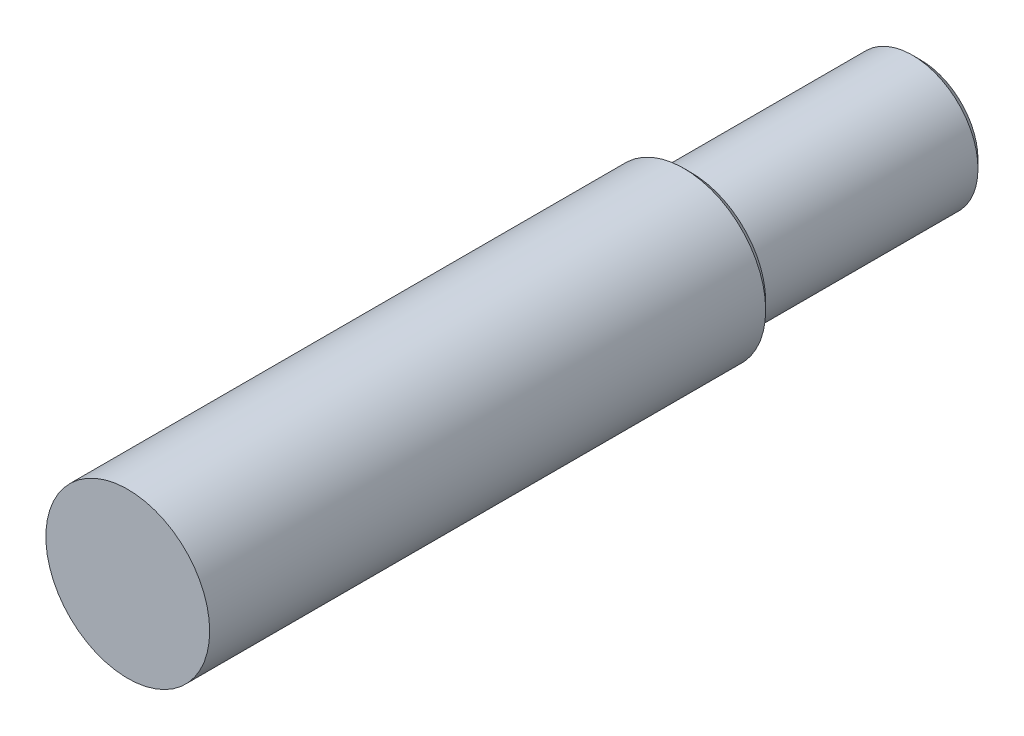
ISO-10303-21;
HEADER;
FILE_DESCRIPTION(('STEP AP214'),'2;1');
FILE_NAME('part.step','',(''),(''),'','','');
FILE_SCHEMA(('AUTOMOTIVE_DESIGN { 1 0 10303 214 1 1 1 1 }'));
ENDSEC;
DATA;
#1=APPLICATION_CONTEXT('core data for automotive mechanical design processes');
#2=APPLICATION_PROTOCOL_DEFINITION('international standard','automotive_design',2000,#1);
#3=PRODUCT_CONTEXT('',#1,'mechanical');
#4=PRODUCT('Part','Part','',(#3));
#5=PRODUCT_RELATED_PRODUCT_CATEGORY('part','',(#4));
#6=PRODUCT_DEFINITION_FORMATION('','',#4);
#7=PRODUCT_DEFINITION_CONTEXT('part definition',#1,'design');
#8=PRODUCT_DEFINITION('design','',#6,#7);
#9=PRODUCT_DEFINITION_SHAPE('','',#8);
#10=(LENGTH_UNIT() NAMED_UNIT(*) SI_UNIT(.MILLI.,.METRE.));
#11=(NAMED_UNIT(*) PLANE_ANGLE_UNIT() SI_UNIT($,.RADIAN.));
#12=(NAMED_UNIT(*) SI_UNIT($,.STERADIAN.) SOLID_ANGLE_UNIT());
#13=UNCERTAINTY_MEASURE_WITH_UNIT(LENGTH_MEASURE(1.E-05),#10,'distance_accuracy_value','');
#14=(GEOMETRIC_REPRESENTATION_CONTEXT(3) GLOBAL_UNCERTAINTY_ASSIGNED_CONTEXT((#13)) GLOBAL_UNIT_ASSIGNED_CONTEXT((#10,
#11,#12)) REPRESENTATION_CONTEXT('',''));
#15=CARTESIAN_POINT('',(0.,0.,0.));
#16=DIRECTION('',(0.,0.,1.));
#17=DIRECTION('',(1.,0.,0.));
#18=AXIS2_PLACEMENT_3D('',#15,#16,#17);
#19=CARTESIAN_POINT('',(0.,0.,0.));
#20=DIRECTION('',(0.,0.,-1.));
#21=DIRECTION('',(-1.,0.,0.));
#22=AXIS2_PLACEMENT_3D('',#19,#20,#21);
#23=PLANE('',#22);
#24=CARTESIAN_POINT('',(0.,0.,0.));
#25=DIRECTION('',(0.,0.,1.));
#26=DIRECTION('',(1.,0.,0.));
#27=AXIS2_PLACEMENT_3D('',#24,#25,#26);
#28=CIRCLE('',#27,5.);
#29=CARTESIAN_POINT('',(5.,0.,0.));
#30=VERTEX_POINT('',#29);
#31=EDGE_CURVE('E10',#30,#30,#28,.T.);
#32=ORIENTED_EDGE('',*,*,#31,.T.);
#33=EDGE_LOOP('',(#32));
#34=FACE_BOUND('',#33,.T.);
#35=ADVANCED_FACE('F40',(#34),#23,.F.);
#36=CARTESIAN_POINT('',(0.,0.,-48.4));
#37=DIRECTION('',(0.,0.,1.));
#38=DIRECTION('',(1.,0.,0.));
#39=AXIS2_PLACEMENT_3D('',#36,#37,#38);
#40=CYLINDRICAL_SURFACE('',#39,5.);
#41=ORIENTED_EDGE('',*,*,#31,.F.);
#42=EDGE_LOOP('',(#41));
#43=FACE_BOUND('',#42,.T.);
#44=CARTESIAN_POINT('',(0.,0.,-33.94));
#45=DIRECTION('',(0.,0.,1.));
#46=DIRECTION('',(1.,0.,0.));
#47=AXIS2_PLACEMENT_3D('',#44,#45,#46);
#48=CIRCLE('',#47,5.);
#49=CARTESIAN_POINT('',(5.,0.,-33.94));
#50=VERTEX_POINT('',#49);
#51=EDGE_CURVE('E46',#50,#50,#48,.T.);
#52=ORIENTED_EDGE('',*,*,#51,.T.);
#53=EDGE_LOOP('',(#52));
#54=FACE_BOUND('',#53,.T.);
#55=ADVANCED_FACE('F78',(#43,#54),#40,.T.);
#56=CARTESIAN_POINT('',(0.,0.,-34.4));
#57=DIRECTION('',(0.,0.,1.));
#58=DIRECTION('',(1.,0.,0.));
#59=AXIS2_PLACEMENT_3D('',#56,#57,#58);
#60=CONICAL_SURFACE('',#59,4.54,0.785398163397446);
#61=ORIENTED_EDGE('',*,*,#51,.F.);
#62=EDGE_LOOP('',(#61));
#63=FACE_BOUND('',#62,.T.);
#64=CARTESIAN_POINT('',(0.,0.,-34.4));
#65=DIRECTION('',(0.,0.,1.));
#66=DIRECTION('',(1.,0.,0.));
#67=AXIS2_PLACEMENT_3D('',#64,#65,#66);
#68=CIRCLE('',#67,4.54);
#69=CARTESIAN_POINT('',(4.54,0.,-34.4));
#70=VERTEX_POINT('',#69);
#71=EDGE_CURVE('E50',#70,#70,#68,.T.);
#72=ORIENTED_EDGE('',*,*,#71,.T.);
#73=EDGE_LOOP('',(#72));
#74=FACE_BOUND('',#73,.T.);
#75=ADVANCED_FACE('F82',(#63,#74),#60,.T.);
#76=CARTESIAN_POINT('',(0.,4.54,-34.4));
#77=DIRECTION('',(0.,0.,1.));
#78=DIRECTION('',(1.,0.,0.));
#79=AXIS2_PLACEMENT_3D('',#76,#77,#78);
#80=PLANE('',#79);
#81=ORIENTED_EDGE('',*,*,#71,.F.);
#82=EDGE_LOOP('',(#81));
#83=FACE_BOUND('',#82,.T.);
#84=CARTESIAN_POINT('',(0.,0.,-34.4));
#85=DIRECTION('',(0.,0.,1.));
#86=DIRECTION('',(1.,0.,0.));
#87=AXIS2_PLACEMENT_3D('',#84,#85,#86);
#88=CIRCLE('',#87,4.);
#89=CARTESIAN_POINT('',(4.,0.,-34.4));
#90=VERTEX_POINT('',#89);
#91=EDGE_CURVE('E54',#90,#90,#88,.T.);
#92=ORIENTED_EDGE('',*,*,#91,.T.);
#93=EDGE_LOOP('',(#92));
#94=FACE_BOUND('',#93,.T.);
#95=ADVANCED_FACE('F87',(#83,#94),#80,.F.);
#96=CARTESIAN_POINT('',(0.,0.,-48.4));
#97=DIRECTION('',(0.,0.,1.));
#98=DIRECTION('',(1.,0.,0.));
#99=AXIS2_PLACEMENT_3D('',#96,#97,#98);
#100=CYLINDRICAL_SURFACE('',#99,4.);
#101=ORIENTED_EDGE('',*,*,#91,.F.);
#102=EDGE_LOOP('',(#101));
#103=FACE_BOUND('',#102,.T.);
#104=CARTESIAN_POINT('',(0.,0.,-47.9));
#105=DIRECTION('',(0.,0.,1.));
#106=DIRECTION('',(1.,0.,0.));
#107=AXIS2_PLACEMENT_3D('',#104,#105,#106);
#108=CIRCLE('',#107,4.);
#109=CARTESIAN_POINT('',(4.,0.,-47.9));
#110=VERTEX_POINT('',#109);
#111=EDGE_CURVE('E59',#110,#110,#108,.T.);
#112=ORIENTED_EDGE('',*,*,#111,.T.);
#113=EDGE_LOOP('',(#112));
#114=FACE_BOUND('',#113,.T.);
#115=ADVANCED_FACE('F74',(#103,#114),#100,.T.);
#116=CARTESIAN_POINT('',(0.,0.,-48.4));
#117=DIRECTION('',(0.,0.,1.));
#118=DIRECTION('',(1.,0.,0.));
#119=AXIS2_PLACEMENT_3D('',#116,#117,#118);
#120=CONICAL_SURFACE('',#119,3.5,0.785398163397448);
#121=ORIENTED_EDGE('',*,*,#111,.F.);
#122=EDGE_LOOP('',(#121));
#123=FACE_BOUND('',#122,.T.);
#124=CARTESIAN_POINT('',(0.,0.,-48.4));
#125=DIRECTION('',(0.,0.,1.));
#126=DIRECTION('',(1.,0.,0.));
#127=AXIS2_PLACEMENT_3D('',#124,#125,#126);
#128=CIRCLE('',#127,3.5);
#129=CARTESIAN_POINT('',(3.5,0.,-48.4));
#130=VERTEX_POINT('',#129);
#131=EDGE_CURVE('E62',#130,#130,#128,.T.);
#132=ORIENTED_EDGE('',*,*,#131,.T.);
#133=EDGE_LOOP('',(#132));
#134=FACE_BOUND('',#133,.T.);
#135=ADVANCED_FACE('F66',(#123,#134),#120,.T.);
#136=CARTESIAN_POINT('',(0.,3.5,-48.4));
#137=DIRECTION('',(0.,0.,1.));
#138=DIRECTION('',(1.,0.,0.));
#139=AXIS2_PLACEMENT_3D('',#136,#137,#138);
#140=PLANE('',#139);
#141=ORIENTED_EDGE('',*,*,#131,.F.);
#142=EDGE_LOOP('',(#141));
#143=FACE_BOUND('',#142,.T.);
#144=ADVANCED_FACE('F68',(#143),#140,.F.);
#145=CLOSED_SHELL('',(#35,#55,#75,#95,#115,#135,#144));
#146=MANIFOLD_SOLID_BREP('B2',#145);
#147=ADVANCED_BREP_SHAPE_REPRESENTATION('',(#18,#146),#14);
#148=SHAPE_DEFINITION_REPRESENTATION(#9,#147);
ENDSEC;
END-ISO-10303-21;
